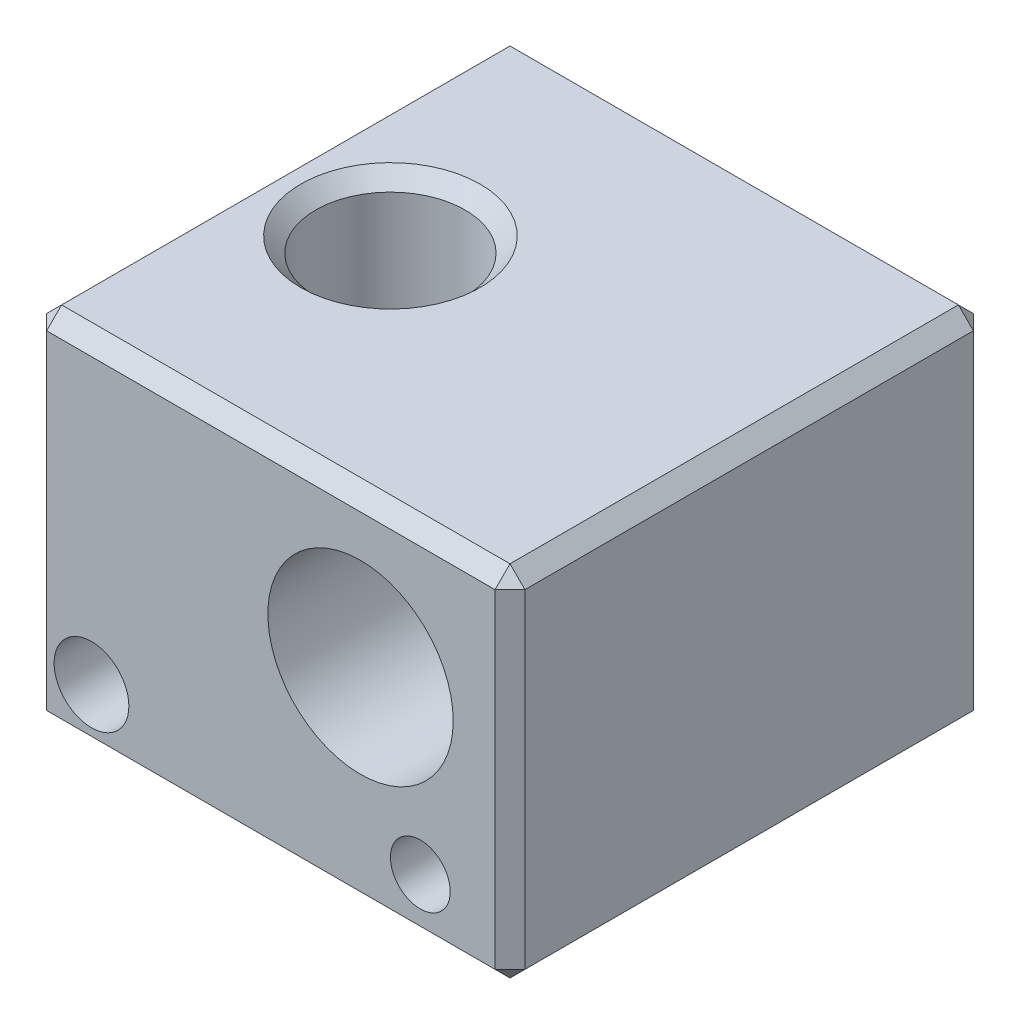
ISO-10303-21;
HEADER;
FILE_DESCRIPTION(('STEP AP214'),'2;1');
FILE_NAME('part.step','',(''),(''),'','','');
FILE_SCHEMA(('AUTOMOTIVE_DESIGN { 1 0 10303 214 1 1 1 1 }'));
ENDSEC;
DATA;
#1=APPLICATION_CONTEXT('core data for automotive mechanical design processes');
#2=APPLICATION_PROTOCOL_DEFINITION('international standard','automotive_design',2000,#1);
#3=PRODUCT_CONTEXT('',#1,'mechanical');
#4=PRODUCT('Part','Part','',(#3));
#5=PRODUCT_RELATED_PRODUCT_CATEGORY('part','',(#4));
#6=PRODUCT_DEFINITION_FORMATION('','',#4);
#7=PRODUCT_DEFINITION_CONTEXT('part definition',#1,'design');
#8=PRODUCT_DEFINITION('design','',#6,#7);
#9=PRODUCT_DEFINITION_SHAPE('','',#8);
#10=(LENGTH_UNIT() NAMED_UNIT(*) SI_UNIT(.MILLI.,.METRE.));
#11=(NAMED_UNIT(*) PLANE_ANGLE_UNIT() SI_UNIT($,.RADIAN.));
#12=(NAMED_UNIT(*) SI_UNIT($,.STERADIAN.) SOLID_ANGLE_UNIT());
#13=UNCERTAINTY_MEASURE_WITH_UNIT(LENGTH_MEASURE(1.E-05),#10,'distance_accuracy_value','');
#14=(GEOMETRIC_REPRESENTATION_CONTEXT(3) GLOBAL_UNCERTAINTY_ASSIGNED_CONTEXT((#13)) GLOBAL_UNIT_ASSIGNED_CONTEXT((#10,
#11,#12)) REPRESENTATION_CONTEXT('',''));
#15=CARTESIAN_POINT('',(0.,0.,0.));
#16=DIRECTION('',(0.,0.,1.));
#17=DIRECTION('',(1.,0.,0.));
#18=AXIS2_PLACEMENT_3D('',#15,#16,#17);
#19=CARTESIAN_POINT('',(-8.,12.,8.));
#20=DIRECTION('',(0.,0.,-1.));
#21=DIRECTION('',(-1.,0.,0.));
#22=AXIS2_PLACEMENT_3D('',#19,#20,#21);
#23=PLANE('',#22);
#24=DIRECTION('',(0.,-1.,0.));
#25=VECTOR('',#24,1.);
#26=CARTESIAN_POINT('',(-7.49999999999999,0.,8.));
#27=LINE('',#26,#25);
#28=CARTESIAN_POINT('',(-7.49999999999999,11.5,8.));
#29=VERTEX_POINT('',#28);
#30=CARTESIAN_POINT('',(-7.49999999999999,0.500000000000004,8.));
#31=VERTEX_POINT('',#30);
#32=EDGE_CURVE('E353',#29,#31,#27,.T.);
#33=ORIENTED_EDGE('',*,*,#32,.T.);
#34=DIRECTION('',(1.,0.,0.));
#35=VECTOR('',#34,1.);
#36=CARTESIAN_POINT('',(-8.,0.500000000000004,8.));
#37=LINE('',#36,#35);
#38=CARTESIAN_POINT('',(7.5,0.500000000000004,8.));
#39=VERTEX_POINT('',#38);
#40=EDGE_CURVE('E361',#31,#39,#37,.T.);
#41=ORIENTED_EDGE('',*,*,#40,.T.);
#42=DIRECTION('',(0.,1.,0.));
#43=VECTOR('',#42,1.);
#44=CARTESIAN_POINT('',(7.5,12.,8.));
#45=LINE('',#44,#43);
#46=CARTESIAN_POINT('',(7.5,11.5,8.));
#47=VERTEX_POINT('',#46);
#48=EDGE_CURVE('E343',#39,#47,#45,.T.);
#49=ORIENTED_EDGE('',*,*,#48,.T.);
#50=DIRECTION('',(-1.,0.,0.));
#51=VECTOR('',#50,1.);
#52=CARTESIAN_POINT('',(-8.,11.5,8.));
#53=LINE('',#52,#51);
#54=EDGE_CURVE('E349',#47,#29,#53,.T.);
#55=ORIENTED_EDGE('',*,*,#54,.T.);
#56=EDGE_LOOP('',(#33,#41,#49,#55));
#57=FACE_BOUND('',#56,.T.);
#58=CARTESIAN_POINT('',(-6.,2.,8.));
#59=DIRECTION('',(0.,0.,1.));
#60=DIRECTION('',(1.,0.,0.));
#61=AXIS2_PLACEMENT_3D('',#58,#59,#60);
#62=CIRCLE('',#61,1.25);
#63=CARTESIAN_POINT('',(-4.75,2.,8.));
#64=VERTEX_POINT('',#63);
#65=EDGE_CURVE('E221',#64,#64,#62,.T.);
#66=ORIENTED_EDGE('',*,*,#65,.F.);
#67=EDGE_LOOP('',(#66));
#68=FACE_BOUND('',#67,.T.);
#69=CARTESIAN_POINT('',(5.,2.,8.));
#70=DIRECTION('',(0.,0.,1.));
#71=DIRECTION('',(1.,0.,0.));
#72=AXIS2_PLACEMENT_3D('',#69,#70,#71);
#73=CIRCLE('',#72,1.);
#74=CARTESIAN_POINT('',(6.,2.,8.));
#75=VERTEX_POINT('',#74);
#76=EDGE_CURVE('E418',#75,#75,#73,.T.);
#77=ORIENTED_EDGE('',*,*,#76,.F.);
#78=EDGE_LOOP('',(#77));
#79=FACE_BOUND('',#78,.T.);
#80=CARTESIAN_POINT('',(3.,7.,8.));
#81=DIRECTION('',(0.,0.,1.));
#82=DIRECTION('',(1.,0.,0.));
#83=AXIS2_PLACEMENT_3D('',#80,#81,#82);
#84=CIRCLE('',#83,3.1);
#85=CARTESIAN_POINT('',(6.1,7.,8.));
#86=VERTEX_POINT('',#85);
#87=EDGE_CURVE('E412',#86,#86,#84,.T.);
#88=ORIENTED_EDGE('',*,*,#87,.F.);
#89=EDGE_LOOP('',(#88));
#90=FACE_BOUND('',#89,.T.);
#91=ADVANCED_FACE('F32',(#57,#68,#79,#90),#23,.F.);
#92=CARTESIAN_POINT('',(8.,12.,8.));
#93=DIRECTION('',(-1.,0.,0.));
#94=DIRECTION('',(0.,0.,1.));
#95=AXIS2_PLACEMENT_3D('',#92,#93,#94);
#96=PLANE('',#95);
#97=DIRECTION('',(0.,0.,1.));
#98=VECTOR('',#97,1.);
#99=CARTESIAN_POINT('',(8.,11.5,8.));
#100=LINE('',#99,#98);
#101=CARTESIAN_POINT('',(8.,11.5,-7.5));
#102=VERTEX_POINT('',#101);
#103=CARTESIAN_POINT('',(8.,11.5,7.5));
#104=VERTEX_POINT('',#103);
#105=EDGE_CURVE('E363',#102,#104,#100,.T.);
#106=ORIENTED_EDGE('',*,*,#105,.T.);
#107=DIRECTION('',(0.,-1.,0.));
#108=VECTOR('',#107,1.);
#109=CARTESIAN_POINT('',(8.,12.,7.5));
#110=LINE('',#109,#108);
#111=CARTESIAN_POINT('',(8.,0.5,7.5));
#112=VERTEX_POINT('',#111);
#113=EDGE_CURVE('E345',#104,#112,#110,.T.);
#114=ORIENTED_EDGE('',*,*,#113,.T.);
#115=DIRECTION('',(0.,0.,-1.));
#116=VECTOR('',#115,1.);
#117=CARTESIAN_POINT('',(8.,0.5,8.));
#118=LINE('',#117,#116);
#119=CARTESIAN_POINT('',(8.,0.5,-7.5));
#120=VERTEX_POINT('',#119);
#121=EDGE_CURVE('E367',#112,#120,#118,.T.);
#122=ORIENTED_EDGE('',*,*,#121,.T.);
#123=DIRECTION('',(0.,1.,0.));
#124=VECTOR('',#123,1.);
#125=CARTESIAN_POINT('',(8.,12.,-7.5));
#126=LINE('',#125,#124);
#127=EDGE_CURVE('E365',#120,#102,#126,.T.);
#128=ORIENTED_EDGE('',*,*,#127,.T.);
#129=EDGE_LOOP('',(#106,#114,#122,#128));
#130=FACE_BOUND('',#129,.T.);
#131=ADVANCED_FACE('F253',(#130),#96,.F.);
#132=CARTESIAN_POINT('',(-8.,12.,-8.));
#133=DIRECTION('',(0.,0.,-1.));
#134=DIRECTION('',(-1.,0.,0.));
#135=AXIS2_PLACEMENT_3D('',#132,#133,#134);
#136=PLANE('',#135);
#137=DIRECTION('',(-1.,0.,0.));
#138=VECTOR('',#137,1.);
#139=CARTESIAN_POINT('',(-8.,0.500000000000004,-8.));
#140=LINE('',#139,#138);
#141=CARTESIAN_POINT('',(7.5,0.500000000000004,-8.));
#142=VERTEX_POINT('',#141);
#143=CARTESIAN_POINT('',(-7.49999999999999,0.500000000000004,-8.));
#144=VERTEX_POINT('',#143);
#145=EDGE_CURVE('E356',#142,#144,#140,.T.);
#146=ORIENTED_EDGE('',*,*,#145,.T.);
#147=DIRECTION('',(0.,1.,0.));
#148=VECTOR('',#147,1.);
#149=CARTESIAN_POINT('',(-7.49999999999999,12.,-8.));
#150=LINE('',#149,#148);
#151=CARTESIAN_POINT('',(-7.49999999999999,11.5,-8.));
#152=VERTEX_POINT('',#151);
#153=EDGE_CURVE('E351',#144,#152,#150,.T.);
#154=ORIENTED_EDGE('',*,*,#153,.T.);
#155=DIRECTION('',(1.,0.,0.));
#156=VECTOR('',#155,1.);
#157=CARTESIAN_POINT('',(-8.,11.5,-8.));
#158=LINE('',#157,#156);
#159=CARTESIAN_POINT('',(7.5,11.5,-8.));
#160=VERTEX_POINT('',#159);
#161=EDGE_CURVE('E382',#152,#160,#158,.T.);
#162=ORIENTED_EDGE('',*,*,#161,.T.);
#163=DIRECTION('',(0.,-1.,0.));
#164=VECTOR('',#163,1.);
#165=CARTESIAN_POINT('',(7.5,0.,-8.));
#166=LINE('',#165,#164);
#167=EDGE_CURVE('E384',#160,#142,#166,.T.);
#168=ORIENTED_EDGE('',*,*,#167,.T.);
#169=EDGE_LOOP('',(#146,#154,#162,#168));
#170=FACE_BOUND('',#169,.T.);
#171=CARTESIAN_POINT('',(5.,2.,-8.));
#172=DIRECTION('',(0.,0.,1.));
#173=DIRECTION('',(1.,0.,0.));
#174=AXIS2_PLACEMENT_3D('',#171,#172,#173);
#175=CIRCLE('',#174,1.);
#176=CARTESIAN_POINT('',(6.,2.,-8.));
#177=VERTEX_POINT('',#176);
#178=EDGE_CURVE('E415',#177,#177,#175,.T.);
#179=ORIENTED_EDGE('',*,*,#178,.T.);
#180=EDGE_LOOP('',(#179));
#181=FACE_BOUND('',#180,.T.);
#182=CARTESIAN_POINT('',(3.,7.,-8.));
#183=DIRECTION('',(0.,0.,1.));
#184=DIRECTION('',(1.,0.,0.));
#185=AXIS2_PLACEMENT_3D('',#182,#183,#184);
#186=CIRCLE('',#185,3.1);
#187=CARTESIAN_POINT('',(6.1,7.,-8.));
#188=VERTEX_POINT('',#187);
#189=EDGE_CURVE('E142',#188,#188,#186,.T.);
#190=ORIENTED_EDGE('',*,*,#189,.T.);
#191=EDGE_LOOP('',(#190));
#192=FACE_BOUND('',#191,.T.);
#193=ADVANCED_FACE('F259',(#170,#181,#192),#136,.T.);
#194=CARTESIAN_POINT('',(-8.,12.,8.));
#195=DIRECTION('',(-1.,0.,0.));
#196=DIRECTION('',(0.,0.,1.));
#197=AXIS2_PLACEMENT_3D('',#194,#195,#196);
#198=PLANE('',#197);
#199=DIRECTION('',(0.,-1.,0.));
#200=VECTOR('',#199,1.);
#201=CARTESIAN_POINT('',(-8.,12.,-7.5));
#202=LINE('',#201,#200);
#203=CARTESIAN_POINT('',(-8.,11.5,-7.5));
#204=VERTEX_POINT('',#203);
#205=CARTESIAN_POINT('',(-8.,0.500000000000004,-7.5));
#206=VERTEX_POINT('',#205);
#207=EDGE_CURVE('E377',#204,#206,#202,.T.);
#208=ORIENTED_EDGE('',*,*,#207,.T.);
#209=DIRECTION('',(0.,0.,1.));
#210=VECTOR('',#209,1.);
#211=CARTESIAN_POINT('',(-8.,0.500000000000004,8.));
#212=LINE('',#211,#210);
#213=CARTESIAN_POINT('',(-8.,0.500000000000004,7.5));
#214=VERTEX_POINT('',#213);
#215=EDGE_CURVE('E148',#206,#214,#212,.T.);
#216=ORIENTED_EDGE('',*,*,#215,.T.);
#217=DIRECTION('',(0.,1.,0.));
#218=VECTOR('',#217,1.);
#219=CARTESIAN_POINT('',(-8.,12.,7.5));
#220=LINE('',#219,#218);
#221=CARTESIAN_POINT('',(-8.,11.5,7.5));
#222=VERTEX_POINT('',#221);
#223=EDGE_CURVE('E391',#214,#222,#220,.T.);
#224=ORIENTED_EDGE('',*,*,#223,.T.);
#225=DIRECTION('',(0.,0.,-1.));
#226=VECTOR('',#225,1.);
#227=CARTESIAN_POINT('',(-8.,11.5,8.));
#228=LINE('',#227,#226);
#229=EDGE_CURVE('E393',#222,#204,#228,.T.);
#230=ORIENTED_EDGE('',*,*,#229,.T.);
#231=EDGE_LOOP('',(#208,#216,#224,#230));
#232=FACE_BOUND('',#231,.T.);
#233=ADVANCED_FACE('F453',(#232),#198,.T.);
#234=CARTESIAN_POINT('',(0.,12.,0.));
#235=DIRECTION('',(0.,1.,0.));
#236=DIRECTION('',(0.,0.,1.));
#237=AXIS2_PLACEMENT_3D('',#234,#235,#236);
#238=PLANE('',#237);
#239=DIRECTION('',(-1.,0.,0.));
#240=VECTOR('',#239,1.);
#241=CARTESIAN_POINT('',(0.,12.,-7.5));
#242=LINE('',#241,#240);
#243=CARTESIAN_POINT('',(7.5,12.,-7.5));
#244=VERTEX_POINT('',#243);
#245=CARTESIAN_POINT('',(-7.5,12.,-7.5));
#246=VERTEX_POINT('',#245);
#247=EDGE_CURVE('E41',#244,#246,#242,.T.);
#248=ORIENTED_EDGE('',*,*,#247,.T.);
#249=DIRECTION('',(0.,0.,1.));
#250=VECTOR('',#249,1.);
#251=CARTESIAN_POINT('',(-7.5,12.,0.));
#252=LINE('',#251,#250);
#253=CARTESIAN_POINT('',(-7.5,12.,7.5));
#254=VERTEX_POINT('',#253);
#255=EDGE_CURVE('E11',#246,#254,#252,.T.);
#256=ORIENTED_EDGE('',*,*,#255,.T.);
#257=DIRECTION('',(1.,0.,0.));
#258=VECTOR('',#257,1.);
#259=CARTESIAN_POINT('',(8.,12.,7.5));
#260=LINE('',#259,#258);
#261=CARTESIAN_POINT('',(7.5,12.,7.5));
#262=VERTEX_POINT('',#261);
#263=EDGE_CURVE('E373',#254,#262,#260,.T.);
#264=ORIENTED_EDGE('',*,*,#263,.T.);
#265=DIRECTION('',(0.,0.,-1.));
#266=VECTOR('',#265,1.);
#267=CARTESIAN_POINT('',(7.5,12.,-8.));
#268=LINE('',#267,#266);
#269=EDGE_CURVE('E52',#262,#244,#268,.T.);
#270=ORIENTED_EDGE('',*,*,#269,.T.);
#271=EDGE_LOOP('',(#248,#256,#264,#270));
#272=FACE_BOUND('',#271,.T.);
#273=CARTESIAN_POINT('',(-4.,12.,0.));
#274=DIRECTION('',(0.,1.,0.));
#275=DIRECTION('',(0.,0.,1.));
#276=AXIS2_PLACEMENT_3D('',#273,#274,#275);
#277=CIRCLE('',#276,2.99999999999999);
#278=CARTESIAN_POINT('',(-4.,12.,2.99999999999999));
#279=VERTEX_POINT('',#278);
#280=EDGE_CURVE('E370',#279,#279,#277,.F.);
#281=ORIENTED_EDGE('',*,*,#280,.T.);
#282=EDGE_LOOP('',(#281));
#283=FACE_BOUND('',#282,.T.);
#284=ADVANCED_FACE('F446',(#272,#283),#238,.T.);
#285=CARTESIAN_POINT('',(0.,0.,0.));
#286=DIRECTION('',(0.,1.,0.));
#287=DIRECTION('',(0.,0.,1.));
#288=AXIS2_PLACEMENT_3D('',#285,#286,#287);
#289=PLANE('',#288);
#290=CARTESIAN_POINT('',(-4.,0.,0.));
#291=DIRECTION('',(0.,1.,0.));
#292=DIRECTION('',(0.,0.,1.));
#293=AXIS2_PLACEMENT_3D('',#290,#291,#292);
#294=CIRCLE('',#293,3.);
#295=CARTESIAN_POINT('',(-4.,0.,3.));
#296=VERTEX_POINT('',#295);
#297=EDGE_CURVE('E403',#296,#296,#294,.T.);
#298=ORIENTED_EDGE('',*,*,#297,.T.);
#299=EDGE_LOOP('',(#298));
#300=FACE_BOUND('',#299,.T.);
#301=CARTESIAN_POINT('',(2.,0.,0.));
#302=DIRECTION('',(0.,1.,0.));
#303=DIRECTION('',(0.,0.,1.));
#304=AXIS2_PLACEMENT_3D('',#301,#302,#303);
#305=CIRCLE('',#304,1.75);
#306=CARTESIAN_POINT('',(2.,0.,1.75));
#307=VERTEX_POINT('',#306);
#308=EDGE_CURVE('E406',#307,#307,#305,.T.);
#309=ORIENTED_EDGE('',*,*,#308,.T.);
#310=EDGE_LOOP('',(#309));
#311=FACE_BOUND('',#310,.T.);
#312=DIRECTION('',(1.,0.,0.));
#313=VECTOR('',#312,1.);
#314=CARTESIAN_POINT('',(8.,0.,-7.5));
#315=LINE('',#314,#313);
#316=CARTESIAN_POINT('',(-7.5,0.,-7.5));
#317=VERTEX_POINT('',#316);
#318=CARTESIAN_POINT('',(7.5,0.,-7.5));
#319=VERTEX_POINT('',#318);
#320=EDGE_CURVE('E124',#317,#319,#315,.T.);
#321=ORIENTED_EDGE('',*,*,#320,.T.);
#322=DIRECTION('',(0.,0.,1.));
#323=VECTOR('',#322,1.);
#324=CARTESIAN_POINT('',(7.5,0.,0.));
#325=LINE('',#324,#323);
#326=CARTESIAN_POINT('',(7.5,0.,7.5));
#327=VERTEX_POINT('',#326);
#328=EDGE_CURVE('E409',#319,#327,#325,.T.);
#329=ORIENTED_EDGE('',*,*,#328,.T.);
#330=DIRECTION('',(-1.,0.,0.));
#331=VECTOR('',#330,1.);
#332=CARTESIAN_POINT('',(0.,0.,7.5));
#333=LINE('',#332,#331);
#334=CARTESIAN_POINT('',(-7.5,0.,7.5));
#335=VERTEX_POINT('',#334);
#336=EDGE_CURVE('E126',#327,#335,#333,.T.);
#337=ORIENTED_EDGE('',*,*,#336,.T.);
#338=DIRECTION('',(0.,0.,-1.));
#339=VECTOR('',#338,1.);
#340=CARTESIAN_POINT('',(-7.5,0.,-8.));
#341=LINE('',#340,#339);
#342=EDGE_CURVE('E120',#335,#317,#341,.T.);
#343=ORIENTED_EDGE('',*,*,#342,.T.);
#344=EDGE_LOOP('',(#321,#329,#337,#343));
#345=FACE_BOUND('',#344,.T.);
#346=ADVANCED_FACE('F122',(#300,#311,#345),#289,.F.);
#347=CARTESIAN_POINT('',(3.,7.,-8.));
#348=DIRECTION('',(0.,0.,1.));
#349=DIRECTION('',(1.,0.,0.));
#350=AXIS2_PLACEMENT_3D('',#347,#348,#349);
#351=CYLINDRICAL_SURFACE('',#350,3.1);
#352=CARTESIAN_POINT('',(2.,4.06571984977576,-1.25));
#353=CARTESIAN_POINT('',(2.06412407102761,4.04386931657047,-1.24999682356544));
#354=CARTESIAN_POINT('',(2.1290323605544,4.02411324985325,-1.24504633684303));
#355=CARTESIAN_POINT('',(2.25852514450525,3.98923249124023,-1.22473081712279));
#356=CARTESIAN_POINT('',(2.32310928391037,3.97411209996811,-1.20935615557821));
#357=CARTESIAN_POINT('',(2.44989951240688,3.94851243111399,-1.16813357100094));
#358=CARTESIAN_POINT('',(2.5121031224863,3.93803787752112,-1.14227503862974));
#359=CARTESIAN_POINT('',(2.63195571275444,3.92132984840443,-1.08059009030169));
#360=CARTESIAN_POINT('',(2.68960522979696,3.9150958723238,-1.04476485151625));
#361=CARTESIAN_POINT('',(2.79749646548957,3.9061553785297,-0.964844569883464));
#362=CARTESIAN_POINT('',(2.84785468706466,3.90338624247298,-0.920913307988026));
#363=CARTESIAN_POINT('',(2.94096515404917,3.9002113379841,-0.825546991201818));
#364=CARTESIAN_POINT('',(2.98371611790489,3.89980596739803,-0.77411067462625));
#365=CARTESIAN_POINT('',(3.06159260293196,3.90035946609992,-0.663497060760644));
#366=CARTESIAN_POINT('',(3.09645925371717,3.90135848340574,-0.604137697597038));
#367=CARTESIAN_POINT('',(3.15599100394901,3.90378325578923,-0.48051332323618));
#368=CARTESIAN_POINT('',(3.18065507855612,3.90520905371185,-0.41624781998927));
#369=CARTESIAN_POINT('',(3.219563460487,3.90772172802315,-0.283004227305716));
#370=CARTESIAN_POINT('',(3.23355335949016,3.90879999521813,-0.213951486933704));
#371=CARTESIAN_POINT('',(3.24975342466547,3.91006624436077,-0.0744708002820152));
#372=CARTESIAN_POINT('',(3.25196372633312,3.91025423654886,-0.0040428698298939));
#373=CARTESIAN_POINT('',(3.24454584579713,3.90965852729883,0.13610331981758));
#374=CARTESIAN_POINT('',(3.23493084752302,3.90887590797932,0.205822282120605));
#375=CARTESIAN_POINT('',(3.20416096316388,3.90669215451381,0.342658473349358));
#376=CARTESIAN_POINT('',(3.18300525336871,3.90529097621996,0.409775516198639));
#377=CARTESIAN_POINT('',(3.12971705925274,3.90260076032698,0.539600864597366));
#378=CARTESIAN_POINT('',(3.09757104261829,3.90131186344619,0.602303619527018));
#379=CARTESIAN_POINT('',(3.02320544748315,3.89986461575388,0.721443742705734));
#380=CARTESIAN_POINT('',(2.98098576274907,3.89970627686539,0.777881044872323));
#381=CARTESIAN_POINT('',(2.88783342606414,3.90168164861602,0.882695629692789));
#382=CARTESIAN_POINT('',(2.83692789470841,3.90380833082803,0.931097102225148));
#383=CARTESIAN_POINT('',(2.72789903274865,3.91148275042813,1.01859946114047));
#384=CARTESIAN_POINT('',(2.6697779427384,3.91702942794207,1.0577032237314));
#385=CARTESIAN_POINT('',(2.55012644860688,3.93224260272356,1.12446031488305));
#386=CARTESIAN_POINT('',(2.48875355593523,3.9417786318946,1.15242580114432));
#387=CARTESIAN_POINT('',(2.36312125667163,3.96545446304068,1.19795912574914));
#388=CARTESIAN_POINT('',(2.29886232190712,3.97959351483077,1.21552865707629));
#389=CARTESIAN_POINT('',(2.17069358533456,4.01226682493206,1.23997912488614));
#390=CARTESIAN_POINT('',(2.10679724119453,4.03072012533362,1.24704113706527));
#391=CARTESIAN_POINT('',(1.98004597127627,4.07183711455998,1.25145005951004));
#392=CARTESIAN_POINT('',(1.91719133547124,4.09450195497261,1.24879430886528));
#393=CARTESIAN_POINT('',(1.79039996352613,4.14486637335437,1.23404889696496));
#394=CARTESIAN_POINT('',(1.72661340015781,4.17278229677925,1.22141881599695));
#395=CARTESIAN_POINT('',(1.60309462789989,4.23172480365729,1.18704722608764));
#396=CARTESIAN_POINT('',(1.54336344063695,4.26275216610093,1.16530343105146));
#397=CARTESIAN_POINT('',(1.42117063361051,4.33113821293562,1.11019217671031));
#398=CARTESIAN_POINT('',(1.35939678232038,4.36879094402457,1.07566592104613));
#399=CARTESIAN_POINT('',(1.24282899693574,4.4451575339971,0.997068324896723));
#400=CARTESIAN_POINT('',(1.18804788503108,4.48387318839118,0.952979839015347));
#401=CARTESIAN_POINT('',(1.07981131798573,4.5652493581044,0.84973208913941));
#402=CARTESIAN_POINT('',(1.02740262887541,4.60778841664885,0.78937125648153));
#403=CARTESIAN_POINT('',(0.933940511899614,4.68803781259185,0.657652699139252));
#404=CARTESIAN_POINT('',(0.892858403867074,4.72576021366949,0.58632347533955));
#405=CARTESIAN_POINT('',(0.837584924562768,4.77855333774515,0.462557639917995));
#406=CARTESIAN_POINT('',(0.819123133548135,4.79676287087563,0.413367344271981));
#407=CARTESIAN_POINT('',(0.78826980528795,4.82773679133903,0.311499179493662));
#408=CARTESIAN_POINT('',(0.77586854424242,4.84050989685295,0.25882705197902));
#409=CARTESIAN_POINT('',(0.757881546309418,4.85918640303962,0.150576807086338));
#410=CARTESIAN_POINT('',(0.752359461653582,4.86502562241385,0.0949764403431551));
#411=CARTESIAN_POINT('',(0.748865472828148,4.86870869109976,-0.0167257193774438));
#412=CARTESIAN_POINT('',(0.75089069399976,4.86655558457313,-0.0728273133239362));
#413=CARTESIAN_POINT('',(0.761578516592351,4.85535245667867,-0.176640207564639));
#414=CARTESIAN_POINT('',(0.769401951034631,4.84717513891782,-0.224540654398175));
#415=CARTESIAN_POINT('',(0.790189830408191,4.82584267352125,-0.318052868932751));
#416=CARTESIAN_POINT('',(0.803158016152508,4.81268390412906,-0.363662944029742));
#417=CARTESIAN_POINT('',(0.840162649243759,4.77603236941032,-0.470880626168048));
#418=CARTESIAN_POINT('',(0.866560750198721,4.75052707780665,-0.530981431141114));
#419=CARTESIAN_POINT('',(0.927112096806266,4.69460608468315,-0.644654810619277));
#420=CARTESIAN_POINT('',(0.96128358816086,4.66417887978581,-0.698211562882469));
#421=CARTESIAN_POINT('',(1.04663268271053,4.59204167799534,-0.812383187083013));
#422=CARTESIAN_POINT('',(1.09990535564506,4.54952185264107,-0.870922323350582));
#423=CARTESIAN_POINT('',(1.21609478271498,4.46368107503741,-0.976818044097293));
#424=CARTESIAN_POINT('',(1.27901991633881,4.42035945574847,-1.02416482064182));
#425=CARTESIAN_POINT('',(1.41392776615344,4.33527163579194,-1.10694157287936));
#426=CARTESIAN_POINT('',(1.48596282556899,4.29351639302137,-1.14229794759976));
#427=CARTESIAN_POINT('',(1.63734346211578,4.21424966883542,-1.19894283194074));
#428=CARTESIAN_POINT('',(1.71666261513442,4.17672386857871,-1.22028006615794));
#429=CARTESIAN_POINT('',(1.83136793930619,4.12848715119251,-1.23902278442863));
#430=CARTESIAN_POINT('',(1.86466000756247,4.11516072866024,-1.2431091379948));
#431=CARTESIAN_POINT('',(1.93189370742814,4.08959773467645,-1.24859903306798));
#432=CARTESIAN_POINT('',(1.96583554893592,4.07736152287063,-1.25000169236203));
#433=CARTESIAN_POINT('',(2.,4.06571984977576,-1.25));
#434=B_SPLINE_CURVE_WITH_KNOTS('',3,(#352,#353,#354,#355,#356,#357,#358,#359,#360,#361,#362,
#363,#364,#365,#366,#367,#368,#369,#370,#371,#372,#373,#374,#375,#376,#377,#378,#379,#380,#381,
#382,#383,#384,#385,#386,#387,#388,#389,#390,#391,#392,#393,#394,#395,#396,#397,#398,#399,#400,
#401,#402,#403,#404,#405,#406,#407,#408,#409,#410,#411,#412,#413,#414,#415,#416,#417,#418,#419,
#420,#421,#422,#423,#424,#425,#426,#427,#428,#429,#430,#431,#432,#433),.UNSPECIFIED.,.T.,.F.,(4,
2,2,2,2,2,2,2,2,2,2,2,2,2,2,2,2,2,2,2,2,2,2,2,2,2,2,2,2,2,2,2,2,2,2,2,2,2,2,2,4),(0.,
0.203106901637013,0.406401664025732,0.609902669700279,0.813379649991945,1.01312353075626,
1.21290102950349,1.41850722043965,1.62413405931888,1.83452067354489,2.04490486778157,
2.25505471888995,2.46521957125866,2.67564413620872,2.88607092032087,3.09585230705912,
3.30556871411916,3.50890505804192,3.71220827947522,3.91196568210335,4.11177778624364,
4.32322687709546,4.53472903986192,4.77426968848165,5.01424344552382,5.28461256836008,
5.55429066399378,5.72053905381196,5.88651982393155,6.05402525513779,6.22146689248854,
6.36849795003851,6.51563611222958,6.72574116876292,6.93634456763189,7.20454767246493,
7.47298494124712,7.74304134015153,8.01215410127126,8.120331198527,8.2285438508205),.UNSPECIFIED.);
#435=CARTESIAN_POINT('',(2.,4.06571984977576,-1.25));
#436=VERTEX_POINT('',#435);
#437=EDGE_CURVE('E215',#436,#436,#434,.T.);
#438=ORIENTED_EDGE('',*,*,#437,.T.);
#439=EDGE_LOOP('',(#438));
#440=FACE_BOUND('',#439,.T.);
#441=ORIENTED_EDGE('',*,*,#189,.F.);
#442=EDGE_LOOP('',(#441));
#443=FACE_BOUND('',#442,.T.);
#444=ORIENTED_EDGE('',*,*,#87,.T.);
#445=EDGE_LOOP('',(#444));
#446=FACE_BOUND('',#445,.T.);
#447=ADVANCED_FACE('F436',(#440,#443,#446),#351,.F.);
#448=CARTESIAN_POINT('',(5.,2.,-8.));
#449=DIRECTION('',(0.,0.,1.));
#450=DIRECTION('',(1.,0.,0.));
#451=AXIS2_PLACEMENT_3D('',#448,#449,#450);
#452=CYLINDRICAL_SURFACE('',#451,1.);
#453=ORIENTED_EDGE('',*,*,#178,.F.);
#454=EDGE_LOOP('',(#453));
#455=FACE_BOUND('',#454,.T.);
#456=ORIENTED_EDGE('',*,*,#76,.T.);
#457=EDGE_LOOP('',(#456));
#458=FACE_BOUND('',#457,.T.);
#459=ADVANCED_FACE('F438',(#455,#458),#452,.F.);
#460=CARTESIAN_POINT('',(-6.,2.,3.5));
#461=DIRECTION('',(0.,0.,-1.));
#462=DIRECTION('',(-1.,0.,0.));
#463=AXIS2_PLACEMENT_3D('',#460,#461,#462);
#464=PLANE('',#463);
#465=CARTESIAN_POINT('',(-6.,2.,3.5));
#466=DIRECTION('',(0.,0.,1.));
#467=DIRECTION('',(1.,0.,0.));
#468=AXIS2_PLACEMENT_3D('',#465,#466,#467);
#469=CIRCLE('',#468,1.25);
#470=CARTESIAN_POINT('',(-4.75,2.,3.5));
#471=VERTEX_POINT('',#470);
#472=EDGE_CURVE('E226',#471,#471,#469,.T.);
#473=ORIENTED_EDGE('',*,*,#472,.T.);
#474=EDGE_LOOP('',(#473));
#475=FACE_BOUND('',#474,.T.);
#476=ADVANCED_FACE('F425',(#475),#464,.F.);
#477=CARTESIAN_POINT('',(-6.,2.,8.));
#478=DIRECTION('',(0.,0.,1.));
#479=DIRECTION('',(1.,0.,0.));
#480=AXIS2_PLACEMENT_3D('',#477,#478,#479);
#481=CYLINDRICAL_SURFACE('',#480,1.25);
#482=ORIENTED_EDGE('',*,*,#472,.F.);
#483=EDGE_LOOP('',(#482));
#484=FACE_BOUND('',#483,.T.);
#485=ORIENTED_EDGE('',*,*,#65,.T.);
#486=EDGE_LOOP('',(#485));
#487=FACE_BOUND('',#486,.T.);
#488=ADVANCED_FACE('F248',(#484,#487),#481,.F.);
#489=CARTESIAN_POINT('',(-4.,12.,0.));
#490=DIRECTION('',(0.,1.,0.));
#491=DIRECTION('',(0.,0.,1.));
#492=AXIS2_PLACEMENT_3D('',#489,#490,#491);
#493=CYLINDRICAL_SURFACE('',#492,2.49999999999999);
#494=CARTESIAN_POINT('',(-4.,0.500000000000007,0.));
#495=DIRECTION('',(0.,1.,0.));
#496=DIRECTION('',(0.,0.,1.));
#497=AXIS2_PLACEMENT_3D('',#494,#495,#496);
#498=CIRCLE('',#497,2.49999999999999);
#499=CARTESIAN_POINT('',(-4.,0.500000000000007,2.49999999999999));
#500=VERTEX_POINT('',#499);
#501=EDGE_CURVE('E397',#500,#500,#498,.F.);
#502=ORIENTED_EDGE('',*,*,#501,.T.);
#503=EDGE_LOOP('',(#502));
#504=FACE_BOUND('',#503,.T.);
#505=CARTESIAN_POINT('',(-4.,11.5,0.));
#506=DIRECTION('',(0.,1.,0.));
#507=DIRECTION('',(0.,0.,1.));
#508=AXIS2_PLACEMENT_3D('',#505,#506,#507);
#509=CIRCLE('',#508,2.49999999999999);
#510=CARTESIAN_POINT('',(-4.,11.5,2.49999999999999));
#511=VERTEX_POINT('',#510);
#512=EDGE_CURVE('E400',#511,#511,#509,.T.);
#513=ORIENTED_EDGE('',*,*,#512,.T.);
#514=EDGE_LOOP('',(#513));
#515=FACE_BOUND('',#514,.T.);
#516=ADVANCED_FACE('F239',(#504,#515),#493,.F.);
#517=CARTESIAN_POINT('',(2.,0.,0.));
#518=DIRECTION('',(0.,-1.,0.));
#519=DIRECTION('',(0.,0.,-1.));
#520=AXIS2_PLACEMENT_3D('',#517,#518,#519);
#521=CYLINDRICAL_SURFACE('',#520,1.25);
#522=CARTESIAN_POINT('',(2.,0.499999999999996,0.));
#523=DIRECTION('',(0.,1.,0.));
#524=DIRECTION('',(0.,0.,1.));
#525=AXIS2_PLACEMENT_3D('',#522,#523,#524);
#526=CIRCLE('',#525,1.25);
#527=CARTESIAN_POINT('',(2.,0.499999999999996,1.25));
#528=VERTEX_POINT('',#527);
#529=EDGE_CURVE('E395',#528,#528,#526,.F.);
#530=ORIENTED_EDGE('',*,*,#529,.T.);
#531=EDGE_LOOP('',(#530));
#532=FACE_BOUND('',#531,.T.);
#533=ORIENTED_EDGE('',*,*,#437,.F.);
#534=EDGE_LOOP('',(#533));
#535=FACE_BOUND('',#534,.T.);
#536=ADVANCED_FACE('F235',(#532,#535),#521,.F.);
#537=CARTESIAN_POINT('',(-4.,0.,0.));
#538=DIRECTION('',(0.,-1.,0.));
#539=DIRECTION('',(0.,0.,-1.));
#540=AXIS2_PLACEMENT_3D('',#537,#538,#539);
#541=CONICAL_SURFACE('',#540,3.,0.785398163397445);
#542=ORIENTED_EDGE('',*,*,#501,.F.);
#543=EDGE_LOOP('',(#542));
#544=FACE_BOUND('',#543,.T.);
#545=ORIENTED_EDGE('',*,*,#297,.F.);
#546=EDGE_LOOP('',(#545));
#547=FACE_BOUND('',#546,.T.);
#548=ADVANCED_FACE('F238',(#544,#547),#541,.F.);
#549=CARTESIAN_POINT('',(2.,0.499999999999996,0.));
#550=DIRECTION('',(0.,-1.,0.));
#551=DIRECTION('',(0.,0.,-1.));
#552=AXIS2_PLACEMENT_3D('',#549,#550,#551);
#553=CONICAL_SURFACE('',#552,1.25,0.785398163397451);
#554=ORIENTED_EDGE('',*,*,#308,.F.);
#555=EDGE_LOOP('',(#554));
#556=FACE_BOUND('',#555,.T.);
#557=ORIENTED_EDGE('',*,*,#529,.F.);
#558=EDGE_LOOP('',(#557));
#559=FACE_BOUND('',#558,.T.);
#560=ADVANCED_FACE('F245',(#556,#559),#553,.F.);
#561=CARTESIAN_POINT('',(8.,12.,7.5));
#562=DIRECTION('',(-0.707106781186545,0.,-0.70710678118655));
#563=DIRECTION('',(0.,-1.,0.));
#564=AXIS2_PLACEMENT_3D('',#561,#562,#563);
#565=PLANE('',#564);
#566=DIRECTION('',(-0.70710678118655,0.,0.707106781186545));
#567=VECTOR('',#566,1.);
#568=CARTESIAN_POINT('',(7.5,11.5,8.));
#569=LINE('',#568,#567);
#570=EDGE_CURVE('E36',#47,#104,#569,.F.);
#571=ORIENTED_EDGE('',*,*,#570,.F.);
#572=ORIENTED_EDGE('',*,*,#48,.F.);
#573=DIRECTION('',(0.70710678118655,0.,-0.707106781186545));
#574=VECTOR('',#573,1.);
#575=CARTESIAN_POINT('',(8.,0.5,7.5));
#576=LINE('',#575,#574);
#577=EDGE_CURVE('E208',#112,#39,#576,.F.);
#578=ORIENTED_EDGE('',*,*,#577,.F.);
#579=ORIENTED_EDGE('',*,*,#113,.F.);
#580=EDGE_LOOP('',(#571,#572,#578,#579));
#581=FACE_BOUND('',#580,.T.);
#582=ADVANCED_FACE('F268',(#581),#565,.F.);
#583=CARTESIAN_POINT('',(7.5,11.5,8.));
#584=DIRECTION('',(0.577350269189626,0.577350269189622,0.57735026918963));
#585=DIRECTION('',(0.70710678118655,0.,-0.707106781186545));
#586=AXIS2_PLACEMENT_3D('',#583,#584,#585);
#587=PLANE('',#586);
#588=DIRECTION('',(0.,-0.70710678118655,0.707106781186545));
#589=VECTOR('',#588,1.);
#590=CARTESIAN_POINT('',(7.5,11.5,8.));
#591=LINE('',#590,#589);
#592=EDGE_CURVE('E203',#47,#262,#591,.F.);
#593=ORIENTED_EDGE('',*,*,#592,.F.);
#594=ORIENTED_EDGE('',*,*,#570,.T.);
#595=DIRECTION('',(-0.707106781186545,0.70710678118655,0.));
#596=VECTOR('',#595,1.);
#597=CARTESIAN_POINT('',(7.75,11.75,7.5));
#598=LINE('',#597,#596);
#599=EDGE_CURVE('E206',#262,#104,#598,.F.);
#600=ORIENTED_EDGE('',*,*,#599,.F.);
#601=EDGE_LOOP('',(#593,#594,#600));
#602=FACE_BOUND('',#601,.T.);
#603=ADVANCED_FACE('F335',(#602),#587,.T.);
#604=CARTESIAN_POINT('',(8.,0.5,7.5));
#605=DIRECTION('',(0.577350269189622,-0.577350269189626,0.57735026918963));
#606=DIRECTION('',(0.,-0.70710678118655,-0.707106781186545));
#607=AXIS2_PLACEMENT_3D('',#604,#605,#606);
#608=PLANE('',#607);
#609=DIRECTION('',(-0.70710678118655,-0.707106781186545,0.));
#610=VECTOR('',#609,1.);
#611=CARTESIAN_POINT('',(8.,0.5,7.5));
#612=LINE('',#611,#610);
#613=EDGE_CURVE('E197',#112,#327,#612,.T.);
#614=ORIENTED_EDGE('',*,*,#613,.F.);
#615=ORIENTED_EDGE('',*,*,#577,.T.);
#616=DIRECTION('',(0.,0.70710678118655,0.707106781186545));
#617=VECTOR('',#616,1.);
#618=CARTESIAN_POINT('',(7.5,0.250000000000002,7.75));
#619=LINE('',#618,#617);
#620=EDGE_CURVE('E200',#327,#39,#619,.T.);
#621=ORIENTED_EDGE('',*,*,#620,.F.);
#622=EDGE_LOOP('',(#614,#615,#621));
#623=FACE_BOUND('',#622,.T.);
#624=ADVANCED_FACE('F331',(#623),#608,.T.);
#625=CARTESIAN_POINT('',(7.5,12.,0.));
#626=DIRECTION('',(0.70710678118655,0.707106781186545,0.));
#627=DIRECTION('',(0.,0.,1.));
#628=AXIS2_PLACEMENT_3D('',#625,#626,#627);
#629=PLANE('',#628);
#630=ORIENTED_EDGE('',*,*,#599,.T.);
#631=ORIENTED_EDGE('',*,*,#105,.F.);
#632=DIRECTION('',(0.707106781186545,-0.70710678118655,0.));
#633=VECTOR('',#632,1.);
#634=CARTESIAN_POINT('',(8.,11.5,-7.5));
#635=LINE('',#634,#633);
#636=EDGE_CURVE('E191',#244,#102,#635,.T.);
#637=ORIENTED_EDGE('',*,*,#636,.F.);
#638=ORIENTED_EDGE('',*,*,#269,.F.);
#639=EDGE_LOOP('',(#630,#631,#637,#638));
#640=FACE_BOUND('',#639,.T.);
#641=ADVANCED_FACE('F327',(#640),#629,.T.);
#642=CARTESIAN_POINT('',(0.,12.,7.5));
#643=DIRECTION('',(0.,0.707106781186545,0.70710678118655));
#644=DIRECTION('',(-1.,0.,0.));
#645=AXIS2_PLACEMENT_3D('',#642,#643,#644);
#646=PLANE('',#645);
#647=ORIENTED_EDGE('',*,*,#592,.T.);
#648=ORIENTED_EDGE('',*,*,#263,.F.);
#649=DIRECTION('',(0.,0.70710678118655,-0.707106781186545));
#650=VECTOR('',#649,1.);
#651=CARTESIAN_POINT('',(-7.5,11.75,7.75));
#652=LINE('',#651,#650);
#653=EDGE_CURVE('E188',#29,#254,#652,.T.);
#654=ORIENTED_EDGE('',*,*,#653,.F.);
#655=ORIENTED_EDGE('',*,*,#54,.F.);
#656=EDGE_LOOP('',(#647,#648,#654,#655));
#657=FACE_BOUND('',#656,.T.);
#658=ADVANCED_FACE('F323',(#657),#646,.T.);
#659=CARTESIAN_POINT('',(-7.49999999999999,12.,8.));
#660=DIRECTION('',(-0.707106781186545,0.,0.70710678118655));
#661=DIRECTION('',(0.,1.,0.));
#662=AXIS2_PLACEMENT_3D('',#659,#660,#661);
#663=PLANE('',#662);
#664=DIRECTION('',(-0.70710678118655,0.,-0.707106781186545));
#665=VECTOR('',#664,1.);
#666=CARTESIAN_POINT('',(-7.49999999999999,0.500000000000004,8.));
#667=LINE('',#666,#665);
#668=EDGE_CURVE('E182',#31,#214,#667,.T.);
#669=ORIENTED_EDGE('',*,*,#668,.F.);
#670=ORIENTED_EDGE('',*,*,#32,.F.);
#671=DIRECTION('',(0.70710678118655,0.,0.707106781186545));
#672=VECTOR('',#671,1.);
#673=CARTESIAN_POINT('',(-8.,11.5,7.5));
#674=LINE('',#673,#672);
#675=EDGE_CURVE('E185',#222,#29,#674,.T.);
#676=ORIENTED_EDGE('',*,*,#675,.F.);
#677=ORIENTED_EDGE('',*,*,#223,.F.);
#678=EDGE_LOOP('',(#669,#670,#676,#677));
#679=FACE_BOUND('',#678,.T.);
#680=ADVANCED_FACE('F319',(#679),#663,.T.);
#681=CARTESIAN_POINT('',(-8.,0.500000000000004,8.));
#682=DIRECTION('',(0.,0.707106781186545,-0.70710678118655));
#683=DIRECTION('',(1.,0.,0.));
#684=AXIS2_PLACEMENT_3D('',#681,#682,#683);
#685=PLANE('',#684);
#686=ORIENTED_EDGE('',*,*,#620,.T.);
#687=ORIENTED_EDGE('',*,*,#40,.F.);
#688=DIRECTION('',(0.,-0.70710678118655,-0.707106781186545));
#689=VECTOR('',#688,1.);
#690=CARTESIAN_POINT('',(-7.49999999999999,0.500000000000004,8.));
#691=LINE('',#690,#689);
#692=EDGE_CURVE('E180',#335,#31,#691,.F.);
#693=ORIENTED_EDGE('',*,*,#692,.F.);
#694=ORIENTED_EDGE('',*,*,#336,.F.);
#695=EDGE_LOOP('',(#686,#687,#693,#694));
#696=FACE_BOUND('',#695,.T.);
#697=ADVANCED_FACE('F315',(#696),#685,.F.);
#698=CARTESIAN_POINT('',(8.,0.5,8.));
#699=DIRECTION('',(-0.707106781186545,0.70710678118655,0.));
#700=DIRECTION('',(0.,0.,-1.));
#701=AXIS2_PLACEMENT_3D('',#698,#699,#700);
#702=PLANE('',#701);
#703=ORIENTED_EDGE('',*,*,#613,.T.);
#704=ORIENTED_EDGE('',*,*,#328,.F.);
#705=DIRECTION('',(0.70710678118655,0.707106781186545,0.));
#706=VECTOR('',#705,1.);
#707=CARTESIAN_POINT('',(8.,0.5,-7.5));
#708=LINE('',#707,#706);
#709=EDGE_CURVE('E177',#120,#319,#708,.F.);
#710=ORIENTED_EDGE('',*,*,#709,.F.);
#711=ORIENTED_EDGE('',*,*,#121,.F.);
#712=EDGE_LOOP('',(#703,#704,#710,#711));
#713=FACE_BOUND('',#712,.T.);
#714=ADVANCED_FACE('F311',(#713),#702,.F.);
#715=CARTESIAN_POINT('',(7.5,12.,-8.));
#716=DIRECTION('',(0.70710678118655,0.,-0.707106781186545));
#717=DIRECTION('',(0.,1.,0.));
#718=AXIS2_PLACEMENT_3D('',#715,#716,#717);
#719=PLANE('',#718);
#720=DIRECTION('',(-0.707106781186545,0.,-0.70710678118655));
#721=VECTOR('',#720,1.);
#722=CARTESIAN_POINT('',(8.,11.5,-7.5));
#723=LINE('',#722,#721);
#724=EDGE_CURVE('E194',#102,#160,#723,.T.);
#725=ORIENTED_EDGE('',*,*,#724,.F.);
#726=ORIENTED_EDGE('',*,*,#127,.F.);
#727=DIRECTION('',(0.707106781186545,0.,0.70710678118655));
#728=VECTOR('',#727,1.);
#729=CARTESIAN_POINT('',(8.,0.5,-7.5));
#730=LINE('',#729,#728);
#731=EDGE_CURVE('E174',#142,#120,#730,.T.);
#732=ORIENTED_EDGE('',*,*,#731,.F.);
#733=ORIENTED_EDGE('',*,*,#167,.F.);
#734=EDGE_LOOP('',(#725,#726,#732,#733));
#735=FACE_BOUND('',#734,.T.);
#736=ADVANCED_FACE('F307',(#735),#719,.T.);
#737=CARTESIAN_POINT('',(8.,11.5,-7.5));
#738=DIRECTION('',(0.57735026918963,0.577350269189622,-0.577350269189626));
#739=DIRECTION('',(-0.707106781186545,0.,-0.70710678118655));
#740=AXIS2_PLACEMENT_3D('',#737,#738,#739);
#741=PLANE('',#740);
#742=ORIENTED_EDGE('',*,*,#636,.T.);
#743=ORIENTED_EDGE('',*,*,#724,.T.);
#744=DIRECTION('',(0.,-0.70710678118655,-0.707106781186545));
#745=VECTOR('',#744,1.);
#746=CARTESIAN_POINT('',(7.5,11.75,-7.75));
#747=LINE('',#746,#745);
#748=EDGE_CURVE('E171',#244,#160,#747,.T.);
#749=ORIENTED_EDGE('',*,*,#748,.F.);
#750=EDGE_LOOP('',(#742,#743,#749));
#751=FACE_BOUND('',#750,.T.);
#752=ADVANCED_FACE('F303',(#751),#741,.T.);
#753=CARTESIAN_POINT('',(-8.,11.5,7.5));
#754=DIRECTION('',(-0.577350269189626,0.577350269189622,0.57735026918963));
#755=DIRECTION('',(0.70710678118655,0.,0.707106781186545));
#756=AXIS2_PLACEMENT_3D('',#753,#754,#755);
#757=PLANE('',#756);
#758=ORIENTED_EDGE('',*,*,#675,.T.);
#759=ORIENTED_EDGE('',*,*,#653,.T.);
#760=DIRECTION('',(0.707106781186545,0.70710678118655,0.));
#761=VECTOR('',#760,1.);
#762=CARTESIAN_POINT('',(-8.,11.5,7.5));
#763=LINE('',#762,#761);
#764=EDGE_CURVE('E169',#222,#254,#763,.T.);
#765=ORIENTED_EDGE('',*,*,#764,.F.);
#766=EDGE_LOOP('',(#758,#759,#765));
#767=FACE_BOUND('',#766,.T.);
#768=ADVANCED_FACE('F299',(#767),#757,.T.);
#769=CARTESIAN_POINT('',(-7.49999999999999,0.500000000000004,8.));
#770=DIRECTION('',(-0.577350269189626,-0.577350269189622,0.57735026918963));
#771=DIRECTION('',(0.70710678118655,0.,0.707106781186545));
#772=AXIS2_PLACEMENT_3D('',#769,#770,#771);
#773=PLANE('',#772);
#774=ORIENTED_EDGE('',*,*,#692,.T.);
#775=ORIENTED_EDGE('',*,*,#668,.T.);
#776=DIRECTION('',(0.707106781186545,-0.70710678118655,0.));
#777=VECTOR('',#776,1.);
#778=CARTESIAN_POINT('',(-7.75,0.250000000000002,7.5));
#779=LINE('',#778,#777);
#780=EDGE_CURVE('E167',#335,#214,#779,.F.);
#781=ORIENTED_EDGE('',*,*,#780,.F.);
#782=EDGE_LOOP('',(#774,#775,#781));
#783=FACE_BOUND('',#782,.T.);
#784=ADVANCED_FACE('F295',(#783),#773,.T.);
#785=CARTESIAN_POINT('',(8.,0.5,-7.5));
#786=DIRECTION('',(0.577350269189626,-0.577350269189626,-0.577350269189626));
#787=DIRECTION('',(-0.707106781186548,0.,-0.707106781186547));
#788=AXIS2_PLACEMENT_3D('',#785,#786,#787);
#789=PLANE('',#788);
#790=ORIENTED_EDGE('',*,*,#731,.T.);
#791=ORIENTED_EDGE('',*,*,#709,.T.);
#792=DIRECTION('',(0.,0.70710678118655,-0.707106781186545));
#793=VECTOR('',#792,1.);
#794=CARTESIAN_POINT('',(7.5,0.250000000000002,-7.75));
#795=LINE('',#794,#793);
#796=EDGE_CURVE('E141',#142,#319,#795,.F.);
#797=ORIENTED_EDGE('',*,*,#796,.F.);
#798=EDGE_LOOP('',(#790,#791,#797));
#799=FACE_BOUND('',#798,.T.);
#800=ADVANCED_FACE('F291',(#799),#789,.T.);
#801=CARTESIAN_POINT('',(-8.,11.5,-8.));
#802=DIRECTION('',(0.,-0.707106781186545,0.70710678118655));
#803=DIRECTION('',(1.,0.,0.));
#804=AXIS2_PLACEMENT_3D('',#801,#802,#803);
#805=PLANE('',#804);
#806=ORIENTED_EDGE('',*,*,#748,.T.);
#807=ORIENTED_EDGE('',*,*,#161,.F.);
#808=DIRECTION('',(0.,0.70710678118655,0.707106781186545));
#809=VECTOR('',#808,1.);
#810=CARTESIAN_POINT('',(-7.49999999999999,11.5,-8.));
#811=LINE('',#810,#809);
#812=EDGE_CURVE('E163',#246,#152,#811,.F.);
#813=ORIENTED_EDGE('',*,*,#812,.F.);
#814=ORIENTED_EDGE('',*,*,#247,.F.);
#815=EDGE_LOOP('',(#806,#807,#813,#814));
#816=FACE_BOUND('',#815,.T.);
#817=ADVANCED_FACE('F287',(#816),#805,.F.);
#818=CARTESIAN_POINT('',(-8.,11.5,8.));
#819=DIRECTION('',(0.70710678118655,-0.707106781186545,0.));
#820=DIRECTION('',(0.,0.,-1.));
#821=AXIS2_PLACEMENT_3D('',#818,#819,#820);
#822=PLANE('',#821);
#823=ORIENTED_EDGE('',*,*,#764,.T.);
#824=ORIENTED_EDGE('',*,*,#255,.F.);
#825=DIRECTION('',(-0.707106781186545,-0.70710678118655,0.));
#826=VECTOR('',#825,1.);
#827=CARTESIAN_POINT('',(-7.75,11.75,-7.5));
#828=LINE('',#827,#826);
#829=EDGE_CURVE('E152',#204,#246,#828,.F.);
#830=ORIENTED_EDGE('',*,*,#829,.F.);
#831=ORIENTED_EDGE('',*,*,#229,.F.);
#832=EDGE_LOOP('',(#823,#824,#830,#831));
#833=FACE_BOUND('',#832,.T.);
#834=ADVANCED_FACE('F284',(#833),#822,.F.);
#835=CARTESIAN_POINT('',(-7.5,0.,0.));
#836=DIRECTION('',(-0.70710678118655,-0.707106781186545,0.));
#837=DIRECTION('',(0.,0.,1.));
#838=AXIS2_PLACEMENT_3D('',#835,#836,#837);
#839=PLANE('',#838);
#840=ORIENTED_EDGE('',*,*,#780,.T.);
#841=ORIENTED_EDGE('',*,*,#215,.F.);
#842=DIRECTION('',(-0.707106781186545,0.70710678118655,0.));
#843=VECTOR('',#842,1.);
#844=CARTESIAN_POINT('',(-8.,0.500000000000004,-7.5));
#845=LINE('',#844,#843);
#846=EDGE_CURVE('E146',#317,#206,#845,.T.);
#847=ORIENTED_EDGE('',*,*,#846,.F.);
#848=ORIENTED_EDGE('',*,*,#342,.F.);
#849=EDGE_LOOP('',(#840,#841,#847,#848));
#850=FACE_BOUND('',#849,.T.);
#851=ADVANCED_FACE('F147',(#850),#839,.T.);
#852=CARTESIAN_POINT('',(0.,0.,-7.5));
#853=DIRECTION('',(0.,-0.707106781186545,-0.70710678118655));
#854=DIRECTION('',(-1.,0.,0.));
#855=AXIS2_PLACEMENT_3D('',#852,#853,#854);
#856=PLANE('',#855);
#857=ORIENTED_EDGE('',*,*,#796,.T.);
#858=ORIENTED_EDGE('',*,*,#320,.F.);
#859=DIRECTION('',(0.,-0.70710678118655,0.707106781186545));
#860=VECTOR('',#859,1.);
#861=CARTESIAN_POINT('',(-7.5,0.250000000000002,-7.75));
#862=LINE('',#861,#860);
#863=EDGE_CURVE('E138',#144,#317,#862,.T.);
#864=ORIENTED_EDGE('',*,*,#863,.F.);
#865=ORIENTED_EDGE('',*,*,#145,.F.);
#866=EDGE_LOOP('',(#857,#858,#864,#865));
#867=FACE_BOUND('',#866,.T.);
#868=ADVANCED_FACE('F135',(#867),#856,.T.);
#869=CARTESIAN_POINT('',(-7.49999999999999,11.5,-8.));
#870=DIRECTION('',(-0.577350269189626,0.577350269189622,-0.57735026918963));
#871=DIRECTION('',(-0.70710678118655,0.,0.707106781186545));
#872=AXIS2_PLACEMENT_3D('',#869,#870,#871);
#873=PLANE('',#872);
#874=ORIENTED_EDGE('',*,*,#829,.T.);
#875=ORIENTED_EDGE('',*,*,#812,.T.);
#876=DIRECTION('',(0.70710678118655,0.,-0.707106781186545));
#877=VECTOR('',#876,1.);
#878=CARTESIAN_POINT('',(-7.49999999999999,11.5,-8.));
#879=LINE('',#878,#877);
#880=EDGE_CURVE('E156',#204,#152,#879,.T.);
#881=ORIENTED_EDGE('',*,*,#880,.F.);
#882=EDGE_LOOP('',(#874,#875,#881));
#883=FACE_BOUND('',#882,.T.);
#884=ADVANCED_FACE('F276',(#883),#873,.T.);
#885=CARTESIAN_POINT('',(-8.,0.500000000000004,-7.5));
#886=DIRECTION('',(-0.577350269189626,-0.577350269189622,-0.57735026918963));
#887=DIRECTION('',(-0.70710678118655,0.,0.707106781186545));
#888=AXIS2_PLACEMENT_3D('',#885,#886,#887);
#889=PLANE('',#888);
#890=ORIENTED_EDGE('',*,*,#863,.T.);
#891=ORIENTED_EDGE('',*,*,#846,.T.);
#892=DIRECTION('',(-0.70710678118655,0.,0.707106781186545));
#893=VECTOR('',#892,1.);
#894=CARTESIAN_POINT('',(-8.,0.500000000000004,-7.5));
#895=LINE('',#894,#893);
#896=EDGE_CURVE('E155',#144,#206,#895,.T.);
#897=ORIENTED_EDGE('',*,*,#896,.F.);
#898=EDGE_LOOP('',(#890,#891,#897));
#899=FACE_BOUND('',#898,.T.);
#900=ADVANCED_FACE('F154',(#899),#889,.T.);
#901=CARTESIAN_POINT('',(-8.,12.,-7.5));
#902=DIRECTION('',(0.707106781186545,0.,0.70710678118655));
#903=DIRECTION('',(0.,-1.,0.));
#904=AXIS2_PLACEMENT_3D('',#901,#902,#903);
#905=PLANE('',#904);
#906=ORIENTED_EDGE('',*,*,#880,.T.);
#907=ORIENTED_EDGE('',*,*,#153,.F.);
#908=ORIENTED_EDGE('',*,*,#896,.T.);
#909=ORIENTED_EDGE('',*,*,#207,.F.);
#910=EDGE_LOOP('',(#906,#907,#908,#909));
#911=FACE_BOUND('',#910,.T.);
#912=ADVANCED_FACE('F270',(#911),#905,.F.);
#913=CARTESIAN_POINT('',(-4.,11.5,0.));
#914=DIRECTION('',(0.,1.,0.));
#915=DIRECTION('',(0.,0.,1.));
#916=AXIS2_PLACEMENT_3D('',#913,#914,#915);
#917=CONICAL_SURFACE('',#916,2.49999999999999,0.78539816339745);
#918=ORIENTED_EDGE('',*,*,#280,.F.);
#919=EDGE_LOOP('',(#918));
#920=FACE_BOUND('',#919,.T.);
#921=ORIENTED_EDGE('',*,*,#512,.F.);
#922=EDGE_LOOP('',(#921));
#923=FACE_BOUND('',#922,.T.);
#924=ADVANCED_FACE('F34',(#920,#923),#917,.F.);
#925=CLOSED_SHELL('',(#91,#131,#193,#233,#284,#346,#447,#459,#476,#488,#516,#536,#548,#560,#582,
#603,#624,#641,#658,#680,#697,#714,#736,#752,#768,#784,#800,#817,#834,#851,#868,#884,#900,#912,#924));
#926=MANIFOLD_SOLID_BREP('B2',#925);
#927=ADVANCED_BREP_SHAPE_REPRESENTATION('',(#18,#926),#14);
#928=SHAPE_DEFINITION_REPRESENTATION(#9,#927);
ENDSEC;
END-ISO-10303-21;
